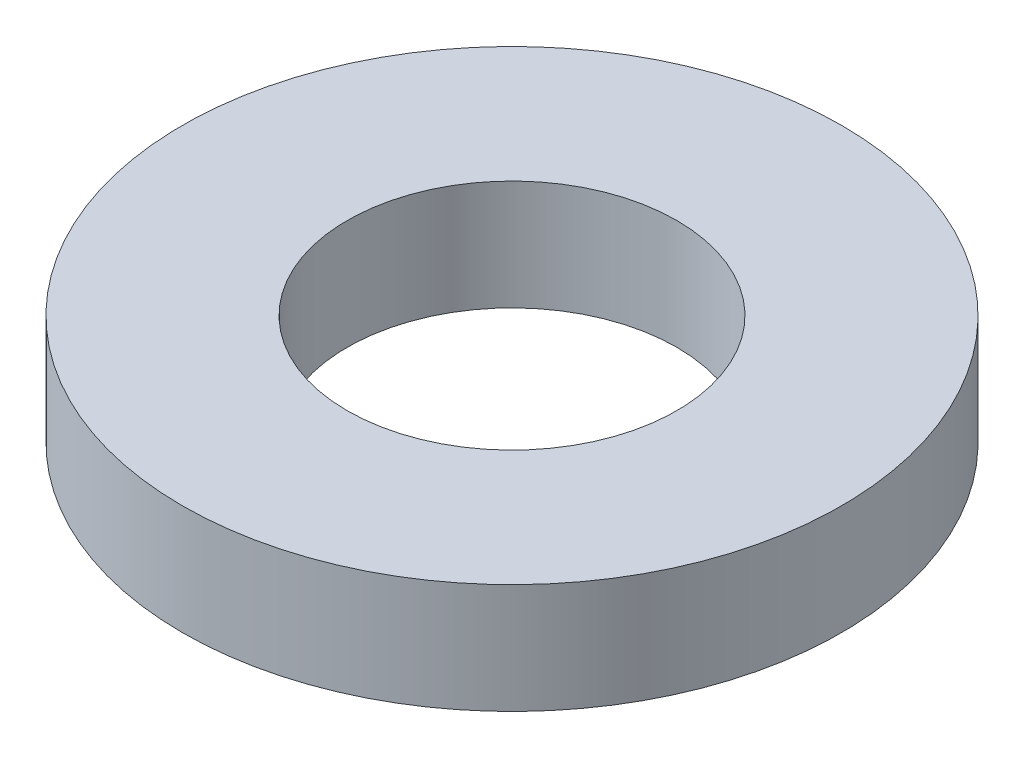
ISO-10303-21;
HEADER;
FILE_DESCRIPTION(('STEP AP214'),'2;1');
FILE_NAME('part.step','',(''),(''),'','','');
FILE_SCHEMA(('AUTOMOTIVE_DESIGN { 1 0 10303 214 1 1 1 1 }'));
ENDSEC;
DATA;
#1=APPLICATION_CONTEXT('core data for automotive mechanical design processes');
#2=APPLICATION_PROTOCOL_DEFINITION('international standard','automotive_design',2000,#1);
#3=PRODUCT_CONTEXT('',#1,'mechanical');
#4=PRODUCT('Part','Part','',(#3));
#5=PRODUCT_RELATED_PRODUCT_CATEGORY('part','',(#4));
#6=PRODUCT_DEFINITION_FORMATION('','',#4);
#7=PRODUCT_DEFINITION_CONTEXT('part definition',#1,'design');
#8=PRODUCT_DEFINITION('design','',#6,#7);
#9=PRODUCT_DEFINITION_SHAPE('','',#8);
#10=(LENGTH_UNIT() NAMED_UNIT(*) SI_UNIT(.MILLI.,.METRE.));
#11=(NAMED_UNIT(*) PLANE_ANGLE_UNIT() SI_UNIT($,.RADIAN.));
#12=(NAMED_UNIT(*) SI_UNIT($,.STERADIAN.) SOLID_ANGLE_UNIT());
#13=UNCERTAINTY_MEASURE_WITH_UNIT(LENGTH_MEASURE(1.E-05),#10,'distance_accuracy_value','');
#14=(GEOMETRIC_REPRESENTATION_CONTEXT(3) GLOBAL_UNCERTAINTY_ASSIGNED_CONTEXT((#13)) GLOBAL_UNIT_ASSIGNED_CONTEXT((#10,
#11,#12)) REPRESENTATION_CONTEXT('',''));
#15=CARTESIAN_POINT('',(0.,0.,0.));
#16=DIRECTION('',(0.,0.,1.));
#17=DIRECTION('',(1.,0.,0.));
#18=AXIS2_PLACEMENT_3D('',#15,#16,#17);
#19=CARTESIAN_POINT('',(0.,1.,0.));
#20=DIRECTION('',(0.,1.,0.));
#21=DIRECTION('',(0.,0.,1.));
#22=AXIS2_PLACEMENT_3D('',#19,#20,#21);
#23=PLANE('',#22);
#24=CARTESIAN_POINT('',(0.,1.,0.));
#25=DIRECTION('',(0.,1.,0.));
#26=DIRECTION('',(0.,0.,1.));
#27=AXIS2_PLACEMENT_3D('',#24,#25,#26);
#28=CIRCLE('',#27,3.);
#29=CARTESIAN_POINT('',(0.,1.,3.));
#30=VERTEX_POINT('',#29);
#31=EDGE_CURVE('E10',#30,#30,#28,.T.);
#32=ORIENTED_EDGE('',*,*,#31,.T.);
#33=EDGE_LOOP('',(#32));
#34=FACE_BOUND('',#33,.T.);
#35=CARTESIAN_POINT('',(0.,1.,0.));
#36=DIRECTION('',(0.,1.,0.));
#37=DIRECTION('',(0.,0.,1.));
#38=AXIS2_PLACEMENT_3D('',#35,#36,#37);
#39=CIRCLE('',#38,1.5);
#40=CARTESIAN_POINT('',(0.,1.,1.5));
#41=VERTEX_POINT('',#40);
#42=EDGE_CURVE('E48',#41,#41,#39,.T.);
#43=ORIENTED_EDGE('',*,*,#42,.F.);
#44=EDGE_LOOP('',(#43));
#45=FACE_BOUND('',#44,.T.);
#46=ADVANCED_FACE('F37',(#34,#45),#23,.T.);
#47=CARTESIAN_POINT('',(0.,0.,0.));
#48=DIRECTION('',(0.,1.,0.));
#49=DIRECTION('',(0.,0.,1.));
#50=AXIS2_PLACEMENT_3D('',#47,#48,#49);
#51=PLANE('',#50);
#52=CARTESIAN_POINT('',(0.,0.,0.));
#53=DIRECTION('',(0.,1.,0.));
#54=DIRECTION('',(0.,0.,1.));
#55=AXIS2_PLACEMENT_3D('',#52,#53,#54);
#56=CIRCLE('',#55,3.);
#57=CARTESIAN_POINT('',(0.,0.,3.));
#58=VERTEX_POINT('',#57);
#59=EDGE_CURVE('E41',#58,#58,#56,.T.);
#60=ORIENTED_EDGE('',*,*,#59,.F.);
#61=EDGE_LOOP('',(#60));
#62=FACE_BOUND('',#61,.T.);
#63=CARTESIAN_POINT('',(0.,0.,0.));
#64=DIRECTION('',(0.,1.,0.));
#65=DIRECTION('',(0.,0.,1.));
#66=AXIS2_PLACEMENT_3D('',#63,#64,#65);
#67=CIRCLE('',#66,1.5);
#68=CARTESIAN_POINT('',(0.,0.,1.5));
#69=VERTEX_POINT('',#68);
#70=EDGE_CURVE('E50',#69,#69,#67,.T.);
#71=ORIENTED_EDGE('',*,*,#70,.T.);
#72=EDGE_LOOP('',(#71));
#73=FACE_BOUND('',#72,.T.);
#74=ADVANCED_FACE('F60',(#62,#73),#51,.F.);
#75=CARTESIAN_POINT('',(0.,1.,0.));
#76=DIRECTION('',(0.,-1.,0.));
#77=DIRECTION('',(0.,0.,-1.));
#78=AXIS2_PLACEMENT_3D('',#75,#76,#77);
#79=CYLINDRICAL_SURFACE('',#78,3.);
#80=ORIENTED_EDGE('',*,*,#31,.F.);
#81=EDGE_LOOP('',(#80));
#82=FACE_BOUND('',#81,.T.);
#83=ORIENTED_EDGE('',*,*,#59,.T.);
#84=EDGE_LOOP('',(#83));
#85=FACE_BOUND('',#84,.T.);
#86=ADVANCED_FACE('F39',(#82,#85),#79,.T.);
#87=CARTESIAN_POINT('',(0.,1.,0.));
#88=DIRECTION('',(0.,-1.,0.));
#89=DIRECTION('',(0.,0.,-1.));
#90=AXIS2_PLACEMENT_3D('',#87,#88,#89);
#91=CYLINDRICAL_SURFACE('',#90,1.5);
#92=ORIENTED_EDGE('',*,*,#42,.T.);
#93=EDGE_LOOP('',(#92));
#94=FACE_BOUND('',#93,.T.);
#95=ORIENTED_EDGE('',*,*,#70,.F.);
#96=EDGE_LOOP('',(#95));
#97=FACE_BOUND('',#96,.T.);
#98=ADVANCED_FACE('F56',(#94,#97),#91,.F.);
#99=CLOSED_SHELL('',(#46,#74,#86,#98));
#100=MANIFOLD_SOLID_BREP('B2',#99);
#101=ADVANCED_BREP_SHAPE_REPRESENTATION('',(#18,#100),#14);
#102=SHAPE_DEFINITION_REPRESENTATION(#9,#101);
ENDSEC;
END-ISO-10303-21;
